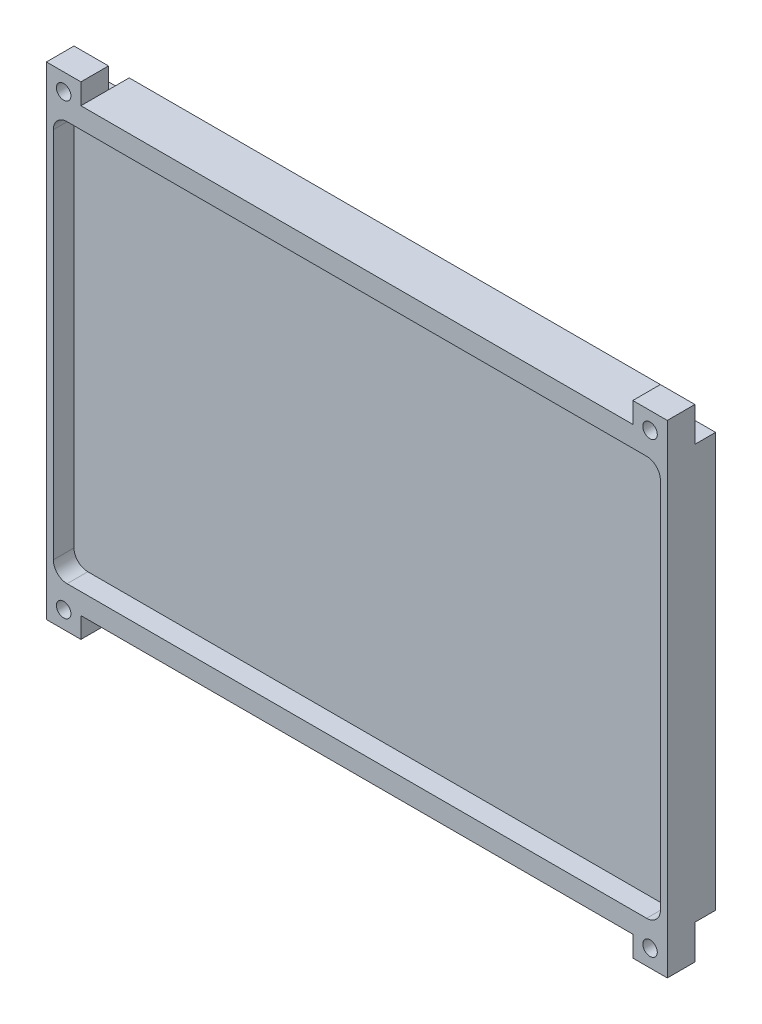
ISO-10303-21;
HEADER;
FILE_DESCRIPTION(('STEP AP214'),'2;1');
FILE_NAME('part.step','',(''),(''),'','','');
FILE_SCHEMA(('AUTOMOTIVE_DESIGN { 1 0 10303 214 1 1 1 1 }'));
ENDSEC;
DATA;
#1=APPLICATION_CONTEXT('core data for automotive mechanical design processes');
#2=APPLICATION_PROTOCOL_DEFINITION('international standard','automotive_design',2000,#1);
#3=PRODUCT_CONTEXT('',#1,'mechanical');
#4=PRODUCT('Part','Part','',(#3));
#5=PRODUCT_RELATED_PRODUCT_CATEGORY('part','',(#4));
#6=PRODUCT_DEFINITION_FORMATION('','',#4);
#7=PRODUCT_DEFINITION_CONTEXT('part definition',#1,'design');
#8=PRODUCT_DEFINITION('design','',#6,#7);
#9=PRODUCT_DEFINITION_SHAPE('','',#8);
#10=(LENGTH_UNIT() NAMED_UNIT(*) SI_UNIT(.MILLI.,.METRE.));
#11=(NAMED_UNIT(*) PLANE_ANGLE_UNIT() SI_UNIT($,.RADIAN.));
#12=(NAMED_UNIT(*) SI_UNIT($,.STERADIAN.) SOLID_ANGLE_UNIT());
#13=UNCERTAINTY_MEASURE_WITH_UNIT(LENGTH_MEASURE(1.E-05),#10,'distance_accuracy_value','');
#14=(GEOMETRIC_REPRESENTATION_CONTEXT(3) GLOBAL_UNCERTAINTY_ASSIGNED_CONTEXT((#13)) GLOBAL_UNIT_ASSIGNED_CONTEXT((#10,
#11,#12)) REPRESENTATION_CONTEXT('',''));
#15=CARTESIAN_POINT('',(0.,0.,0.));
#16=DIRECTION('',(0.,0.,1.));
#17=DIRECTION('',(1.,0.,0.));
#18=AXIS2_PLACEMENT_3D('',#15,#16,#17);
#19=CARTESIAN_POINT('',(-89.0867155495886,42.9813664596273,10.));
#20=DIRECTION('',(0.,1.,0.));
#21=DIRECTION('',(0.,0.,1.));
#22=AXIS2_PLACEMENT_3D('',#19,#20,#21);
#23=PLANE('',#22);
#24=DIRECTION('',(0.,0.,1.));
#25=VECTOR('',#24,1.);
#26=CARTESIAN_POINT('',(-79.0867155495886,42.9813664596273,0.));
#27=LINE('',#26,#25);
#28=CARTESIAN_POINT('',(-79.0867155495886,42.9813664596273,6.));
#29=VERTEX_POINT('',#28);
#30=CARTESIAN_POINT('',(-79.0867155495886,42.9813664596273,10.));
#31=VERTEX_POINT('',#30);
#32=EDGE_CURVE('E254',#29,#31,#27,.T.);
#33=ORIENTED_EDGE('',*,*,#32,.F.);
#34=DIRECTION('',(1.,0.,0.));
#35=VECTOR('',#34,1.);
#36=CARTESIAN_POINT('',(-84.0867155495886,42.9813664596273,6.));
#37=LINE('',#36,#35);
#38=CARTESIAN_POINT('',(-84.0867155495886,42.9813664596273,6.));
#39=VERTEX_POINT('',#38);
#40=EDGE_CURVE('E236',#39,#29,#37,.T.);
#41=ORIENTED_EDGE('',*,*,#40,.F.);
#42=DIRECTION('',(0.,0.,-1.));
#43=VECTOR('',#42,1.);
#44=CARTESIAN_POINT('',(-84.0867155495886,42.9813664596273,3.));
#45=LINE('',#44,#43);
#46=CARTESIAN_POINT('',(-84.0867155495886,42.9813664596273,10.));
#47=VERTEX_POINT('',#46);
#48=EDGE_CURVE('E423',#47,#39,#45,.T.);
#49=ORIENTED_EDGE('',*,*,#48,.F.);
#50=DIRECTION('',(1.,0.,0.));
#51=VECTOR('',#50,1.);
#52=CARTESIAN_POINT('',(-89.0867155495886,42.9813664596273,10.));
#53=LINE('',#52,#51);
#54=EDGE_CURVE('E262',#47,#31,#53,.T.);
#55=ORIENTED_EDGE('',*,*,#54,.T.);
#56=EDGE_LOOP('',(#33,#41,#49,#55));
#57=FACE_BOUND('',#56,.T.);
#58=ADVANCED_FACE('F40',(#57),#23,.T.);
#59=CARTESIAN_POINT('',(-89.0867155495886,-27.0186335403727,10.));
#60=DIRECTION('',(0.,1.,0.));
#61=DIRECTION('',(0.,0.,1.));
#62=AXIS2_PLACEMENT_3D('',#59,#60,#61);
#63=PLANE('',#62);
#64=DIRECTION('',(-1.,0.,0.));
#65=VECTOR('',#64,1.);
#66=CARTESIAN_POINT('',(-84.0867155495886,-27.0186335403727,6.));
#67=LINE('',#66,#65);
#68=CARTESIAN_POINT('',(-79.0867155495886,-27.0186335403727,6.));
#69=VERTEX_POINT('',#68);
#70=CARTESIAN_POINT('',(-84.0867155495886,-27.0186335403727,6.));
#71=VERTEX_POINT('',#70);
#72=EDGE_CURVE('E479',#69,#71,#67,.T.);
#73=ORIENTED_EDGE('',*,*,#72,.F.);
#74=DIRECTION('',(0.,0.,1.));
#75=VECTOR('',#74,1.);
#76=CARTESIAN_POINT('',(-79.0867155495886,-27.0186335403727,0.));
#77=LINE('',#76,#75);
#78=CARTESIAN_POINT('',(-79.0867155495886,-27.0186335403727,10.));
#79=VERTEX_POINT('',#78);
#80=EDGE_CURVE('E297',#69,#79,#77,.T.);
#81=ORIENTED_EDGE('',*,*,#80,.T.);
#82=DIRECTION('',(1.,0.,0.));
#83=VECTOR('',#82,1.);
#84=CARTESIAN_POINT('',(-89.0867155495886,-27.0186335403727,10.));
#85=LINE('',#84,#83);
#86=CARTESIAN_POINT('',(-84.0867155495886,-27.0186335403727,10.));
#87=VERTEX_POINT('',#86);
#88=EDGE_CURVE('E445',#87,#79,#85,.T.);
#89=ORIENTED_EDGE('',*,*,#88,.F.);
#90=DIRECTION('',(0.,0.,1.));
#91=VECTOR('',#90,1.);
#92=CARTESIAN_POINT('',(-84.0867155495886,-27.0186335403727,3.00000000000001));
#93=LINE('',#92,#91);
#94=EDGE_CURVE('E416',#71,#87,#93,.T.);
#95=ORIENTED_EDGE('',*,*,#94,.F.);
#96=EDGE_LOOP('',(#73,#81,#89,#95));
#97=FACE_BOUND('',#96,.T.);
#98=ADVANCED_FACE('F659',(#97),#63,.F.);
#99=DIRECTION('',(0.,0.,1.));
#100=VECTOR('',#99,1.);
#101=CARTESIAN_POINT('',(5.91328445041136,42.9813664596273,3.));
#102=LINE('',#101,#100);
#103=CARTESIAN_POINT('',(5.91328445041136,42.9813664596273,6.));
#104=VERTEX_POINT('',#103);
#105=CARTESIAN_POINT('',(5.91328445041137,42.9813664596273,10.));
#106=VERTEX_POINT('',#105);
#107=EDGE_CURVE('E430',#104,#106,#102,.T.);
#108=ORIENTED_EDGE('',*,*,#107,.F.);
#109=DIRECTION('',(1.,0.,0.));
#110=VECTOR('',#109,1.);
#111=CARTESIAN_POINT('',(5.91328445041136,42.9813664596273,6.));
#112=LINE('',#111,#110);
#113=CARTESIAN_POINT('',(0.913284450411347,42.9813664596273,6.));
#114=VERTEX_POINT('',#113);
#115=EDGE_CURVE('E545',#114,#104,#112,.T.);
#116=ORIENTED_EDGE('',*,*,#115,.F.);
#117=DIRECTION('',(0.,0.,1.));
#118=VECTOR('',#117,1.);
#119=CARTESIAN_POINT('',(0.913284450411375,42.9813664596273,0.));
#120=LINE('',#119,#118);
#121=CARTESIAN_POINT('',(0.913284450411375,42.9813664596273,10.));
#122=VERTEX_POINT('',#121);
#123=EDGE_CURVE('E265',#114,#122,#120,.T.);
#124=ORIENTED_EDGE('',*,*,#123,.T.);
#125=EDGE_CURVE('E441',#122,#106,#53,.T.);
#126=ORIENTED_EDGE('',*,*,#125,.T.);
#127=EDGE_LOOP('',(#108,#116,#124,#126));
#128=FACE_BOUND('',#127,.T.);
#129=ADVANCED_FACE('F614',(#128),#23,.T.);
#130=DIRECTION('',(-1.,0.,0.));
#131=VECTOR('',#130,1.);
#132=CARTESIAN_POINT('',(5.91328445041136,-27.0186335403727,6.));
#133=LINE('',#132,#131);
#134=CARTESIAN_POINT('',(5.91328445041136,-27.0186335403727,6.));
#135=VERTEX_POINT('',#134);
#136=CARTESIAN_POINT('',(0.91328445041132,-27.0186335403727,6.));
#137=VERTEX_POINT('',#136);
#138=EDGE_CURVE('E55',#135,#137,#133,.T.);
#139=ORIENTED_EDGE('',*,*,#138,.F.);
#140=DIRECTION('',(0.,0.,-1.));
#141=VECTOR('',#140,1.);
#142=CARTESIAN_POINT('',(5.91328445041137,-27.0186335403727,2.99999999999999));
#143=LINE('',#142,#141);
#144=CARTESIAN_POINT('',(5.91328445041137,-27.0186335403727,10.));
#145=VERTEX_POINT('',#144);
#146=EDGE_CURVE('E437',#145,#135,#143,.T.);
#147=ORIENTED_EDGE('',*,*,#146,.F.);
#148=CARTESIAN_POINT('',(0.91328445041132,-27.0186335403727,10.));
#149=VERTEX_POINT('',#148);
#150=EDGE_CURVE('E444',#149,#145,#85,.T.);
#151=ORIENTED_EDGE('',*,*,#150,.F.);
#152=DIRECTION('',(0.,0.,1.));
#153=VECTOR('',#152,1.);
#154=CARTESIAN_POINT('',(0.91328445041132,-27.0186335403727,0.));
#155=LINE('',#154,#153);
#156=EDGE_CURVE('E308',#137,#149,#155,.T.);
#157=ORIENTED_EDGE('',*,*,#156,.F.);
#158=EDGE_LOOP('',(#139,#147,#151,#157));
#159=FACE_BOUND('',#158,.T.);
#160=ADVANCED_FACE('F607',(#159),#63,.F.);
#161=CARTESIAN_POINT('',(3.41328445041136,-24.5186335403727,42.));
#162=DIRECTION('',(0.,0.,-1.));
#163=DIRECTION('',(-1.,0.,0.));
#164=AXIS2_PLACEMENT_3D('',#161,#162,#163);
#165=CYLINDRICAL_SURFACE('',#164,1.05);
#166=CARTESIAN_POINT('',(3.41328445041142,-24.5186335403727,10.));
#167=DIRECTION('',(0.,0.,1.));
#168=DIRECTION('',(1.,0.,0.));
#169=AXIS2_PLACEMENT_3D('',#166,#167,#168);
#170=CIRCLE('',#169,1.04999999999999);
#171=CARTESIAN_POINT('',(4.46328445041141,-24.5186335403727,10.));
#172=VERTEX_POINT('',#171);
#173=EDGE_CURVE('E270',#172,#172,#170,.T.);
#174=ORIENTED_EDGE('',*,*,#173,.T.);
#175=EDGE_LOOP('',(#174));
#176=FACE_BOUND('',#175,.T.);
#177=CARTESIAN_POINT('',(3.41328445041136,-24.5186335403727,6.));
#178=DIRECTION('',(0.,0.,-1.));
#179=DIRECTION('',(-1.,0.,0.));
#180=AXIS2_PLACEMENT_3D('',#177,#178,#179);
#181=CIRCLE('',#180,1.05);
#182=CARTESIAN_POINT('',(2.36328445041136,-24.5186335403727,6.));
#183=VERTEX_POINT('',#182);
#184=EDGE_CURVE('E569',#183,#183,#181,.F.);
#185=ORIENTED_EDGE('',*,*,#184,.F.);
#186=EDGE_LOOP('',(#185));
#187=FACE_BOUND('',#186,.T.);
#188=ADVANCED_FACE('F669',(#176,#187),#165,.F.);
#189=CARTESIAN_POINT('',(-81.5867155495886,-24.5186335403727,42.));
#190=DIRECTION('',(0.,0.,-1.));
#191=DIRECTION('',(-1.,0.,0.));
#192=AXIS2_PLACEMENT_3D('',#189,#190,#191);
#193=CYLINDRICAL_SURFACE('',#192,1.04999999999999);
#194=CARTESIAN_POINT('',(-81.5867155495887,-24.5186335403727,10.));
#195=DIRECTION('',(0.,0.,1.));
#196=DIRECTION('',(-1.,0.,0.));
#197=AXIS2_PLACEMENT_3D('',#194,#195,#196);
#198=CIRCLE('',#197,1.04999999999999);
#199=CARTESIAN_POINT('',(-82.6367155495887,-24.5186335403727,10.));
#200=VERTEX_POINT('',#199);
#201=EDGE_CURVE('E264',#200,#200,#198,.T.);
#202=ORIENTED_EDGE('',*,*,#201,.T.);
#203=EDGE_LOOP('',(#202));
#204=FACE_BOUND('',#203,.T.);
#205=CARTESIAN_POINT('',(-81.5867155495886,-24.5186335403727,6.));
#206=DIRECTION('',(0.,0.,-1.));
#207=DIRECTION('',(-1.,0.,0.));
#208=AXIS2_PLACEMENT_3D('',#205,#206,#207);
#209=CIRCLE('',#208,1.04999999999999);
#210=CARTESIAN_POINT('',(-82.6367155495886,-24.5186335403727,6.));
#211=VERTEX_POINT('',#210);
#212=EDGE_CURVE('E289',#211,#211,#209,.F.);
#213=ORIENTED_EDGE('',*,*,#212,.F.);
#214=EDGE_LOOP('',(#213));
#215=FACE_BOUND('',#214,.T.);
#216=ADVANCED_FACE('F673',(#204,#215),#193,.F.);
#217=CARTESIAN_POINT('',(-81.5867155495887,40.4813664596273,42.));
#218=DIRECTION('',(0.,0.,-1.));
#219=DIRECTION('',(-1.,0.,0.));
#220=AXIS2_PLACEMENT_3D('',#217,#218,#219);
#221=CYLINDRICAL_SURFACE('',#220,1.04999999999999);
#222=CARTESIAN_POINT('',(-81.5867155495887,40.4813664596273,10.));
#223=DIRECTION('',(0.,0.,1.));
#224=DIRECTION('',(1.,0.,0.));
#225=AXIS2_PLACEMENT_3D('',#222,#223,#224);
#226=CIRCLE('',#225,1.04999999999999);
#227=CARTESIAN_POINT('',(-80.5367155495887,40.4813664596273,10.));
#228=VERTEX_POINT('',#227);
#229=EDGE_CURVE('E320',#228,#228,#226,.T.);
#230=ORIENTED_EDGE('',*,*,#229,.T.);
#231=EDGE_LOOP('',(#230));
#232=FACE_BOUND('',#231,.T.);
#233=CARTESIAN_POINT('',(-81.5867155495887,40.4813664596273,6.));
#234=DIRECTION('',(0.,0.,-1.));
#235=DIRECTION('',(-1.,0.,0.));
#236=AXIS2_PLACEMENT_3D('',#233,#234,#235);
#237=CIRCLE('',#236,1.04999999999999);
#238=CARTESIAN_POINT('',(-82.6367155495887,40.4813664596273,6.));
#239=VERTEX_POINT('',#238);
#240=EDGE_CURVE('E565',#239,#239,#237,.F.);
#241=ORIENTED_EDGE('',*,*,#240,.F.);
#242=EDGE_LOOP('',(#241));
#243=FACE_BOUND('',#242,.T.);
#244=ADVANCED_FACE('F683',(#232,#243),#221,.F.);
#245=CARTESIAN_POINT('',(3.41328445041138,40.4813664596273,42.));
#246=DIRECTION('',(0.,0.,-1.));
#247=DIRECTION('',(-1.,0.,0.));
#248=AXIS2_PLACEMENT_3D('',#245,#246,#247);
#249=CYLINDRICAL_SURFACE('',#248,1.05);
#250=CARTESIAN_POINT('',(3.41328445041142,40.4813664596273,10.));
#251=DIRECTION('',(0.,0.,1.));
#252=DIRECTION('',(-1.,0.,0.));
#253=AXIS2_PLACEMENT_3D('',#250,#251,#252);
#254=CIRCLE('',#253,1.04999999999999);
#255=CARTESIAN_POINT('',(2.36328445041143,40.4813664596273,10.));
#256=VERTEX_POINT('',#255);
#257=EDGE_CURVE('E316',#256,#256,#254,.T.);
#258=ORIENTED_EDGE('',*,*,#257,.T.);
#259=EDGE_LOOP('',(#258));
#260=FACE_BOUND('',#259,.T.);
#261=CARTESIAN_POINT('',(3.41328445041138,40.4813664596273,6.));
#262=DIRECTION('',(0.,0.,-1.));
#263=DIRECTION('',(-1.,0.,0.));
#264=AXIS2_PLACEMENT_3D('',#261,#262,#263);
#265=CIRCLE('',#264,1.05);
#266=CARTESIAN_POINT('',(2.36328445041138,40.4813664596273,6.));
#267=VERTEX_POINT('',#266);
#268=EDGE_CURVE('E559',#267,#267,#265,.F.);
#269=ORIENTED_EDGE('',*,*,#268,.F.);
#270=EDGE_LOOP('',(#269));
#271=FACE_BOUND('',#270,.T.);
#272=ADVANCED_FACE('F681',(#260,#271),#249,.F.);
#273=CARTESIAN_POINT('',(-79.0867155495886,-27.0186335403727,0.));
#274=DIRECTION('',(-1.,0.,0.));
#275=DIRECTION('',(0.,0.,1.));
#276=AXIS2_PLACEMENT_3D('',#273,#274,#275);
#277=PLANE('',#276);
#278=DIRECTION('',(0.,-1.,0.));
#279=VECTOR('',#278,1.);
#280=CARTESIAN_POINT('',(-79.0867155495886,-27.0186335403727,6.));
#281=LINE('',#280,#279);
#282=CARTESIAN_POINT('',(-79.0867155495886,-24.0186335403727,6.));
#283=VERTEX_POINT('',#282);
#284=EDGE_CURVE('E475',#283,#69,#281,.T.);
#285=ORIENTED_EDGE('',*,*,#284,.F.);
#286=DIRECTION('',(0.,0.,1.));
#287=VECTOR('',#286,1.);
#288=CARTESIAN_POINT('',(-79.0867155495886,-24.0186335403727,0.));
#289=LINE('',#288,#287);
#290=CARTESIAN_POINT('',(-79.0867155495886,-24.0186335403727,10.));
#291=VERTEX_POINT('',#290);
#292=EDGE_CURVE('E302',#283,#291,#289,.T.);
#293=ORIENTED_EDGE('',*,*,#292,.T.);
#294=DIRECTION('',(0.,-1.,0.));
#295=VECTOR('',#294,1.);
#296=CARTESIAN_POINT('',(-79.0867155495886,-27.0186335403727,10.));
#297=LINE('',#296,#295);
#298=EDGE_CURVE('E284',#291,#79,#297,.T.);
#299=ORIENTED_EDGE('',*,*,#298,.T.);
#300=ORIENTED_EDGE('',*,*,#80,.F.);
#301=EDGE_LOOP('',(#285,#293,#299,#300));
#302=FACE_BOUND('',#301,.T.);
#303=ADVANCED_FACE('F483',(#302),#277,.F.);
#304=CARTESIAN_POINT('',(0.91328445041132,-27.0186335403727,0.));
#305=DIRECTION('',(1.,0.,0.));
#306=DIRECTION('',(0.,0.,-1.));
#307=AXIS2_PLACEMENT_3D('',#304,#305,#306);
#308=PLANE('',#307);
#309=DIRECTION('',(0.,1.,0.));
#310=VECTOR('',#309,1.);
#311=CARTESIAN_POINT('',(0.913284450411351,-27.0186335403727,6.));
#312=LINE('',#311,#310);
#313=CARTESIAN_POINT('',(0.913284450411351,-24.0186335403727,6.));
#314=VERTEX_POINT('',#313);
#315=EDGE_CURVE('E510',#137,#314,#312,.T.);
#316=ORIENTED_EDGE('',*,*,#315,.F.);
#317=ORIENTED_EDGE('',*,*,#156,.T.);
#318=DIRECTION('',(0.,1.,0.));
#319=VECTOR('',#318,1.);
#320=CARTESIAN_POINT('',(0.91328445041132,-27.0186335403727,10.));
#321=LINE('',#320,#319);
#322=CARTESIAN_POINT('',(0.91328445041132,-24.0186335403727,10.));
#323=VERTEX_POINT('',#322);
#324=EDGE_CURVE('E288',#149,#323,#321,.T.);
#325=ORIENTED_EDGE('',*,*,#324,.T.);
#326=DIRECTION('',(0.,0.,1.));
#327=VECTOR('',#326,1.);
#328=CARTESIAN_POINT('',(0.91328445041132,-24.0186335403727,0.));
#329=LINE('',#328,#327);
#330=EDGE_CURVE('E307',#314,#323,#329,.T.);
#331=ORIENTED_EDGE('',*,*,#330,.F.);
#332=EDGE_LOOP('',(#316,#317,#325,#331));
#333=FACE_BOUND('',#332,.T.);
#334=ADVANCED_FACE('F734',(#333),#308,.F.);
#335=CARTESIAN_POINT('',(-79.0867155495886,42.9813664596273,0.));
#336=DIRECTION('',(-1.,0.,0.));
#337=DIRECTION('',(0.,0.,1.));
#338=AXIS2_PLACEMENT_3D('',#335,#336,#337);
#339=PLANE('',#338);
#340=DIRECTION('',(0.,-1.,0.));
#341=VECTOR('',#340,1.);
#342=CARTESIAN_POINT('',(-79.0867155495886,42.9813664596273,6.));
#343=LINE('',#342,#341);
#344=CARTESIAN_POINT('',(-79.0867155495886,39.9813664596273,6.));
#345=VERTEX_POINT('',#344);
#346=EDGE_CURVE('E63',#29,#345,#343,.T.);
#347=ORIENTED_EDGE('',*,*,#346,.F.);
#348=ORIENTED_EDGE('',*,*,#32,.T.);
#349=DIRECTION('',(0.,-1.,0.));
#350=VECTOR('',#349,1.);
#351=CARTESIAN_POINT('',(-79.0867155495886,42.9813664596273,10.));
#352=LINE('',#351,#350);
#353=CARTESIAN_POINT('',(-79.0867155495886,39.9813664596273,10.));
#354=VERTEX_POINT('',#353);
#355=EDGE_CURVE('E301',#31,#354,#352,.T.);
#356=ORIENTED_EDGE('',*,*,#355,.T.);
#357=DIRECTION('',(0.,0.,1.));
#358=VECTOR('',#357,1.);
#359=CARTESIAN_POINT('',(-79.0867155495886,39.9813664596273,0.));
#360=LINE('',#359,#358);
#361=EDGE_CURVE('E256',#345,#354,#360,.T.);
#362=ORIENTED_EDGE('',*,*,#361,.F.);
#363=EDGE_LOOP('',(#347,#348,#356,#362));
#364=FACE_BOUND('',#363,.T.);
#365=ADVANCED_FACE('F252',(#364),#339,.F.);
#366=CARTESIAN_POINT('',(0.913284450411375,42.9813664596273,0.));
#367=DIRECTION('',(1.,0.,0.));
#368=DIRECTION('',(0.,0.,-1.));
#369=AXIS2_PLACEMENT_3D('',#366,#367,#368);
#370=PLANE('',#369);
#371=DIRECTION('',(0.,1.,0.));
#372=VECTOR('',#371,1.);
#373=CARTESIAN_POINT('',(0.913284450411347,42.9813664596273,6.));
#374=LINE('',#373,#372);
#375=CARTESIAN_POINT('',(0.913284450411347,39.9813664596273,6.));
#376=VERTEX_POINT('',#375);
#377=EDGE_CURVE('E540',#376,#114,#374,.T.);
#378=ORIENTED_EDGE('',*,*,#377,.F.);
#379=DIRECTION('',(0.,0.,1.));
#380=VECTOR('',#379,1.);
#381=CARTESIAN_POINT('',(0.913284450411375,39.9813664596273,0.));
#382=LINE('',#381,#380);
#383=CARTESIAN_POINT('',(0.913284450411375,39.9813664596273,10.));
#384=VERTEX_POINT('',#383);
#385=EDGE_CURVE('E280',#376,#384,#382,.T.);
#386=ORIENTED_EDGE('',*,*,#385,.T.);
#387=DIRECTION('',(0.,1.,0.));
#388=VECTOR('',#387,1.);
#389=CARTESIAN_POINT('',(0.913284450411375,42.9813664596273,10.));
#390=LINE('',#389,#388);
#391=EDGE_CURVE('E275',#384,#122,#390,.T.);
#392=ORIENTED_EDGE('',*,*,#391,.T.);
#393=ORIENTED_EDGE('',*,*,#123,.F.);
#394=EDGE_LOOP('',(#378,#386,#392,#393));
#395=FACE_BOUND('',#394,.T.);
#396=ADVANCED_FACE('F617',(#395),#370,.F.);
#397=CARTESIAN_POINT('',(0.,0.,10.));
#398=DIRECTION('',(0.,0.,-1.));
#399=DIRECTION('',(-1.,0.,0.));
#400=AXIS2_PLACEMENT_3D('',#397,#398,#399);
#401=PLANE('',#400);
#402=DIRECTION('',(1.,0.,0.));
#403=VECTOR('',#402,1.);
#404=CARTESIAN_POINT('',(-79.0867155495886,39.9813664596273,10.));
#405=LINE('',#404,#403);
#406=EDGE_CURVE('E577',#354,#384,#405,.T.);
#407=ORIENTED_EDGE('',*,*,#406,.F.);
#408=ORIENTED_EDGE('',*,*,#355,.F.);
#409=ORIENTED_EDGE('',*,*,#54,.F.);
#410=DIRECTION('',(0.,1.,0.));
#411=VECTOR('',#410,1.);
#412=CARTESIAN_POINT('',(-84.0867155495886,42.9813664596273,10.));
#413=LINE('',#412,#411);
#414=EDGE_CURVE('E419',#87,#47,#413,.T.);
#415=ORIENTED_EDGE('',*,*,#414,.F.);
#416=ORIENTED_EDGE('',*,*,#88,.T.);
#417=ORIENTED_EDGE('',*,*,#298,.F.);
#418=DIRECTION('',(-1.,0.,0.));
#419=VECTOR('',#418,1.);
#420=CARTESIAN_POINT('',(-79.0867155495886,-24.0186335403727,10.));
#421=LINE('',#420,#419);
#422=EDGE_CURVE('E293',#323,#291,#421,.T.);
#423=ORIENTED_EDGE('',*,*,#422,.F.);
#424=ORIENTED_EDGE('',*,*,#324,.F.);
#425=ORIENTED_EDGE('',*,*,#150,.T.);
#426=DIRECTION('',(0.,-1.,0.));
#427=VECTOR('',#426,1.);
#428=CARTESIAN_POINT('',(5.91328445041136,42.9813664596273,10.));
#429=LINE('',#428,#427);
#430=EDGE_CURVE('E433',#106,#145,#429,.T.);
#431=ORIENTED_EDGE('',*,*,#430,.F.);
#432=ORIENTED_EDGE('',*,*,#125,.F.);
#433=ORIENTED_EDGE('',*,*,#391,.F.);
#434=EDGE_LOOP('',(#407,#408,#409,#415,#416,#417,#423,#424,#425,#431,#432,#433));
#435=FACE_BOUND('',#434,.T.);
#436=DIRECTION('',(1.,0.,0.));
#437=VECTOR('',#436,1.);
#438=CARTESIAN_POINT('',(-81.0867155495886,-21.0186335403727,10.));
#439=LINE('',#438,#437);
#440=CARTESIAN_POINT('',(-81.0867155495886,-21.0186335403727,10.));
#441=VERTEX_POINT('',#440);
#442=CARTESIAN_POINT('',(2.91328445041136,-21.0186335403727,10.));
#443=VERTEX_POINT('',#442);
#444=EDGE_CURVE('E361',#441,#443,#439,.T.);
#445=ORIENTED_EDGE('',*,*,#444,.F.);
#446=CARTESIAN_POINT('',(-81.0867155495886,-19.0186335403727,10.));
#447=DIRECTION('',(0.,0.,1.));
#448=DIRECTION('',(-1.,0.,0.));
#449=AXIS2_PLACEMENT_3D('',#446,#447,#448);
#450=CIRCLE('',#449,2.);
#451=CARTESIAN_POINT('',(-83.0867155495886,-19.0186335403727,10.));
#452=VERTEX_POINT('',#451);
#453=EDGE_CURVE('E324',#452,#441,#450,.T.);
#454=ORIENTED_EDGE('',*,*,#453,.F.);
#455=DIRECTION('',(0.,-1.,0.));
#456=VECTOR('',#455,1.);
#457=CARTESIAN_POINT('',(-83.0867155495886,34.9813664596273,10.));
#458=LINE('',#457,#456);
#459=CARTESIAN_POINT('',(-83.0867155495886,34.9813664596273,10.));
#460=VERTEX_POINT('',#459);
#461=EDGE_CURVE('E330',#460,#452,#458,.T.);
#462=ORIENTED_EDGE('',*,*,#461,.F.);
#463=CARTESIAN_POINT('',(-81.0867155495886,34.9813664596273,10.));
#464=DIRECTION('',(0.,0.,1.));
#465=DIRECTION('',(-1.,0.,0.));
#466=AXIS2_PLACEMENT_3D('',#463,#464,#465);
#467=CIRCLE('',#466,2.);
#468=CARTESIAN_POINT('',(-81.0867155495886,36.9813664596273,10.));
#469=VERTEX_POINT('',#468);
#470=EDGE_CURVE('E381',#469,#460,#467,.T.);
#471=ORIENTED_EDGE('',*,*,#470,.F.);
#472=DIRECTION('',(-1.,0.,0.));
#473=VECTOR('',#472,1.);
#474=CARTESIAN_POINT('',(-81.0867155495886,36.9813664596273,10.));
#475=LINE('',#474,#473);
#476=CARTESIAN_POINT('',(2.91328445041136,36.9813664596273,10.));
#477=VERTEX_POINT('',#476);
#478=EDGE_CURVE('E377',#477,#469,#475,.T.);
#479=ORIENTED_EDGE('',*,*,#478,.F.);
#480=CARTESIAN_POINT('',(2.91328445041138,34.9813664596273,10.));
#481=DIRECTION('',(0.,0.,1.));
#482=DIRECTION('',(-1.,0.,0.));
#483=AXIS2_PLACEMENT_3D('',#480,#481,#482);
#484=CIRCLE('',#483,2.);
#485=CARTESIAN_POINT('',(4.91328445041138,34.9813664596273,10.));
#486=VERTEX_POINT('',#485);
#487=EDGE_CURVE('E373',#486,#477,#484,.T.);
#488=ORIENTED_EDGE('',*,*,#487,.F.);
#489=DIRECTION('',(0.,1.,0.));
#490=VECTOR('',#489,1.);
#491=CARTESIAN_POINT('',(4.91328445041138,34.9813664596273,10.));
#492=LINE('',#491,#490);
#493=CARTESIAN_POINT('',(4.91328445041138,-19.0186335403727,10.));
#494=VERTEX_POINT('',#493);
#495=EDGE_CURVE('E369',#494,#486,#492,.T.);
#496=ORIENTED_EDGE('',*,*,#495,.F.);
#497=CARTESIAN_POINT('',(2.91328445041138,-19.0186335403727,10.));
#498=DIRECTION('',(0.,0.,1.));
#499=DIRECTION('',(1.,0.,0.));
#500=AXIS2_PLACEMENT_3D('',#497,#498,#499);
#501=CIRCLE('',#500,2.);
#502=EDGE_CURVE('E365',#443,#494,#501,.T.);
#503=ORIENTED_EDGE('',*,*,#502,.F.);
#504=EDGE_LOOP('',(#445,#454,#462,#471,#479,#488,#496,#503));
#505=FACE_BOUND('',#504,.T.);
#506=ORIENTED_EDGE('',*,*,#229,.F.);
#507=EDGE_LOOP('',(#506));
#508=FACE_BOUND('',#507,.T.);
#509=ORIENTED_EDGE('',*,*,#257,.F.);
#510=EDGE_LOOP('',(#509));
#511=FACE_BOUND('',#510,.T.);
#512=ORIENTED_EDGE('',*,*,#173,.F.);
#513=EDGE_LOOP('',(#512));
#514=FACE_BOUND('',#513,.T.);
#515=ORIENTED_EDGE('',*,*,#201,.F.);
#516=EDGE_LOOP('',(#515));
#517=FACE_BOUND('',#516,.T.);
#518=ADVANCED_FACE('F593',(#435,#505,#508,#511,#514,#517),#401,.F.);
#519=CARTESIAN_POINT('',(0.,0.,3.));
#520=DIRECTION('',(0.,0.,1.));
#521=DIRECTION('',(1.,0.,0.));
#522=AXIS2_PLACEMENT_3D('',#519,#520,#521);
#523=PLANE('',#522);
#524=DIRECTION('',(0.,1.,0.));
#525=VECTOR('',#524,1.);
#526=CARTESIAN_POINT('',(5.91328445041136,42.9813664596273,3.));
#527=LINE('',#526,#525);
#528=CARTESIAN_POINT('',(5.91328445041136,-22.0186335403727,3.));
#529=VERTEX_POINT('',#528);
#530=CARTESIAN_POINT('',(5.91328445041136,37.9813664596273,3.));
#531=VERTEX_POINT('',#530);
#532=EDGE_CURVE('E426',#529,#531,#527,.T.);
#533=ORIENTED_EDGE('',*,*,#532,.F.);
#534=DIRECTION('',(1.,0.,0.));
#535=VECTOR('',#534,1.);
#536=CARTESIAN_POINT('',(5.91328445041136,-22.0186335403727,3.));
#537=LINE('',#536,#535);
#538=CARTESIAN_POINT('',(0.913284450411351,-22.0186335403727,3.));
#539=VERTEX_POINT('',#538);
#540=EDGE_CURVE('E509',#539,#529,#537,.T.);
#541=ORIENTED_EDGE('',*,*,#540,.F.);
#542=DIRECTION('',(0.,1.,0.));
#543=VECTOR('',#542,1.);
#544=CARTESIAN_POINT('',(0.913284450411351,-27.0186335403727,3.));
#545=LINE('',#544,#543);
#546=CARTESIAN_POINT('',(0.913284450411351,-24.0186335403727,3.));
#547=VERTEX_POINT('',#546);
#548=EDGE_CURVE('E459',#547,#539,#545,.T.);
#549=ORIENTED_EDGE('',*,*,#548,.F.);
#550=DIRECTION('',(-1.,0.,0.));
#551=VECTOR('',#550,1.);
#552=CARTESIAN_POINT('',(0.,-24.0186335403727,3.));
#553=LINE('',#552,#551);
#554=CARTESIAN_POINT('',(-79.0867155495886,-24.0186335403727,3.));
#555=VERTEX_POINT('',#554);
#556=EDGE_CURVE('E48',#547,#555,#553,.T.);
#557=ORIENTED_EDGE('',*,*,#556,.T.);
#558=DIRECTION('',(0.,-1.,0.));
#559=VECTOR('',#558,1.);
#560=CARTESIAN_POINT('',(-79.0867155495886,-27.0186335403727,3.));
#561=LINE('',#560,#559);
#562=CARTESIAN_POINT('',(-79.0867155495886,-22.0186335403727,3.));
#563=VERTEX_POINT('',#562);
#564=EDGE_CURVE('E457',#563,#555,#561,.T.);
#565=ORIENTED_EDGE('',*,*,#564,.F.);
#566=DIRECTION('',(1.,0.,0.));
#567=VECTOR('',#566,1.);
#568=CARTESIAN_POINT('',(-84.0867155495886,-22.0186335403727,3.));
#569=LINE('',#568,#567);
#570=CARTESIAN_POINT('',(-84.0867155495886,-22.0186335403727,3.));
#571=VERTEX_POINT('',#570);
#572=EDGE_CURVE('E493',#571,#563,#569,.T.);
#573=ORIENTED_EDGE('',*,*,#572,.F.);
#574=DIRECTION('',(0.,-1.,0.));
#575=VECTOR('',#574,1.);
#576=CARTESIAN_POINT('',(-84.0867155495886,42.9813664596273,3.));
#577=LINE('',#576,#575);
#578=CARTESIAN_POINT('',(-84.0867155495886,37.9813664596273,3.));
#579=VERTEX_POINT('',#578);
#580=EDGE_CURVE('E391',#579,#571,#577,.T.);
#581=ORIENTED_EDGE('',*,*,#580,.F.);
#582=DIRECTION('',(-1.,0.,0.));
#583=VECTOR('',#582,1.);
#584=CARTESIAN_POINT('',(-84.0867155495886,37.9813664596273,3.));
#585=LINE('',#584,#583);
#586=CARTESIAN_POINT('',(-79.0867155495886,37.9813664596273,3.));
#587=VERTEX_POINT('',#586);
#588=EDGE_CURVE('E248',#587,#579,#585,.T.);
#589=ORIENTED_EDGE('',*,*,#588,.F.);
#590=DIRECTION('',(0.,-1.,0.));
#591=VECTOR('',#590,1.);
#592=CARTESIAN_POINT('',(-79.0867155495886,42.9813664596273,3.));
#593=LINE('',#592,#591);
#594=CARTESIAN_POINT('',(-79.0867155495886,39.9813664596273,3.));
#595=VERTEX_POINT('',#594);
#596=EDGE_CURVE('E503',#595,#587,#593,.T.);
#597=ORIENTED_EDGE('',*,*,#596,.F.);
#598=DIRECTION('',(1.,0.,0.));
#599=VECTOR('',#598,1.);
#600=CARTESIAN_POINT('',(0.,39.9813664596273,3.));
#601=LINE('',#600,#599);
#602=CARTESIAN_POINT('',(0.913284450411375,39.9813664596273,3.));
#603=VERTEX_POINT('',#602);
#604=EDGE_CURVE('E11',#595,#603,#601,.T.);
#605=ORIENTED_EDGE('',*,*,#604,.T.);
#606=DIRECTION('',(0.,1.,0.));
#607=VECTOR('',#606,1.);
#608=CARTESIAN_POINT('',(0.913284450411347,42.9813664596273,3.));
#609=LINE('',#608,#607);
#610=CARTESIAN_POINT('',(0.913284450411347,37.9813664596273,3.));
#611=VERTEX_POINT('',#610);
#612=EDGE_CURVE('E536',#611,#603,#609,.T.);
#613=ORIENTED_EDGE('',*,*,#612,.F.);
#614=DIRECTION('',(-1.,0.,0.));
#615=VECTOR('',#614,1.);
#616=CARTESIAN_POINT('',(5.91328445041136,37.9813664596273,3.));
#617=LINE('',#616,#615);
#618=EDGE_CURVE('E549',#531,#611,#617,.T.);
#619=ORIENTED_EDGE('',*,*,#618,.F.);
#620=EDGE_LOOP('',(#533,#541,#549,#557,#565,#573,#581,#589,#597,#605,#613,#619));
#621=FACE_BOUND('',#620,.T.);
#622=ADVANCED_FACE('F455',(#621),#523,.F.);
#623=CARTESIAN_POINT('',(5.91328445041137,0.,0.));
#624=DIRECTION('',(-1.,0.,0.));
#625=DIRECTION('',(0.,-1.,0.));
#626=AXIS2_PLACEMENT_3D('',#623,#624,#625);
#627=PLANE('',#626);
#628=DIRECTION('',(0.,-1.,0.));
#629=VECTOR('',#628,1.);
#630=CARTESIAN_POINT('',(5.91328445041136,-27.0186335403727,6.));
#631=LINE('',#630,#629);
#632=CARTESIAN_POINT('',(5.91328445041136,-22.0186335403727,6.));
#633=VERTEX_POINT('',#632);
#634=EDGE_CURVE('E517',#633,#135,#631,.T.);
#635=ORIENTED_EDGE('',*,*,#634,.F.);
#636=DIRECTION('',(0.,0.,-1.));
#637=VECTOR('',#636,1.);
#638=CARTESIAN_POINT('',(5.91328445041136,-22.0186335403727,6.));
#639=LINE('',#638,#637);
#640=EDGE_CURVE('E497',#633,#529,#639,.T.);
#641=ORIENTED_EDGE('',*,*,#640,.T.);
#642=ORIENTED_EDGE('',*,*,#532,.T.);
#643=DIRECTION('',(0.,0.,-1.));
#644=VECTOR('',#643,1.);
#645=CARTESIAN_POINT('',(5.91328445041136,37.9813664596273,6.));
#646=LINE('',#645,#644);
#647=CARTESIAN_POINT('',(5.91328445041136,37.9813664596273,6.));
#648=VERTEX_POINT('',#647);
#649=EDGE_CURVE('E548',#648,#531,#646,.T.);
#650=ORIENTED_EDGE('',*,*,#649,.F.);
#651=DIRECTION('',(0.,-1.,0.));
#652=VECTOR('',#651,1.);
#653=CARTESIAN_POINT('',(5.91328445041136,42.9813664596273,6.));
#654=LINE('',#653,#652);
#655=EDGE_CURVE('E531',#104,#648,#654,.T.);
#656=ORIENTED_EDGE('',*,*,#655,.F.);
#657=ORIENTED_EDGE('',*,*,#107,.T.);
#658=ORIENTED_EDGE('',*,*,#430,.T.);
#659=ORIENTED_EDGE('',*,*,#146,.T.);
#660=EDGE_LOOP('',(#635,#641,#642,#650,#656,#657,#658,#659));
#661=FACE_BOUND('',#660,.T.);
#662=ADVANCED_FACE('F610',(#661),#627,.F.);
#663=CARTESIAN_POINT('',(-84.0867155495886,0.,0.));
#664=DIRECTION('',(-1.,0.,0.));
#665=DIRECTION('',(0.,0.,1.));
#666=AXIS2_PLACEMENT_3D('',#663,#664,#665);
#667=PLANE('',#666);
#668=DIRECTION('',(0.,0.,-1.));
#669=VECTOR('',#668,1.);
#670=CARTESIAN_POINT('',(-84.0867155495886,-22.0186335403727,6.));
#671=LINE('',#670,#669);
#672=CARTESIAN_POINT('',(-84.0867155495886,-22.0186335403727,6.));
#673=VERTEX_POINT('',#672);
#674=EDGE_CURVE('E492',#673,#571,#671,.T.);
#675=ORIENTED_EDGE('',*,*,#674,.F.);
#676=DIRECTION('',(0.,1.,0.));
#677=VECTOR('',#676,1.);
#678=CARTESIAN_POINT('',(-84.0867155495886,-27.0186335403727,6.));
#679=LINE('',#678,#677);
#680=EDGE_CURVE('E486',#71,#673,#679,.T.);
#681=ORIENTED_EDGE('',*,*,#680,.F.);
#682=ORIENTED_EDGE('',*,*,#94,.T.);
#683=ORIENTED_EDGE('',*,*,#414,.T.);
#684=ORIENTED_EDGE('',*,*,#48,.T.);
#685=DIRECTION('',(0.,1.,0.));
#686=VECTOR('',#685,1.);
#687=CARTESIAN_POINT('',(-84.0867155495886,42.9813664596273,6.));
#688=LINE('',#687,#686);
#689=CARTESIAN_POINT('',(-84.0867155495886,37.9813664596273,6.));
#690=VERTEX_POINT('',#689);
#691=EDGE_CURVE('E241',#690,#39,#688,.T.);
#692=ORIENTED_EDGE('',*,*,#691,.F.);
#693=DIRECTION('',(0.,0.,-1.));
#694=VECTOR('',#693,1.);
#695=CARTESIAN_POINT('',(-84.0867155495886,37.9813664596273,6.));
#696=LINE('',#695,#694);
#697=EDGE_CURVE('E553',#690,#579,#696,.T.);
#698=ORIENTED_EDGE('',*,*,#697,.T.);
#699=ORIENTED_EDGE('',*,*,#580,.T.);
#700=EDGE_LOOP('',(#675,#681,#682,#683,#684,#692,#698,#699));
#701=FACE_BOUND('',#700,.T.);
#702=ADVANCED_FACE('F648',(#701),#667,.T.);
#703=CARTESIAN_POINT('',(-81.0867155495886,-19.0186335403727,7.));
#704=DIRECTION('',(0.,0.,1.));
#705=DIRECTION('',(1.,0.,0.));
#706=AXIS2_PLACEMENT_3D('',#703,#704,#705);
#707=CYLINDRICAL_SURFACE('',#706,2.);
#708=ORIENTED_EDGE('',*,*,#453,.T.);
#709=DIRECTION('',(0.,0.,1.));
#710=VECTOR('',#709,1.);
#711=CARTESIAN_POINT('',(-81.0867155495886,-21.0186335403727,7.));
#712=LINE('',#711,#710);
#713=CARTESIAN_POINT('',(-81.0867155495886,-21.0186335403727,7.));
#714=VERTEX_POINT('',#713);
#715=EDGE_CURVE('E358',#714,#441,#712,.T.);
#716=ORIENTED_EDGE('',*,*,#715,.F.);
#717=CARTESIAN_POINT('',(-81.0867155495886,-19.0186335403727,7.));
#718=DIRECTION('',(0.,0.,1.));
#719=DIRECTION('',(-1.,0.,0.));
#720=AXIS2_PLACEMENT_3D('',#717,#718,#719);
#721=CIRCLE('',#720,2.);
#722=CARTESIAN_POINT('',(-83.0867155495886,-19.0186335403727,7.));
#723=VERTEX_POINT('',#722);
#724=EDGE_CURVE('E325',#723,#714,#721,.T.);
#725=ORIENTED_EDGE('',*,*,#724,.F.);
#726=DIRECTION('',(0.,0.,1.));
#727=VECTOR('',#726,1.);
#728=CARTESIAN_POINT('',(-83.0867155495886,-19.0186335403727,7.));
#729=LINE('',#728,#727);
#730=EDGE_CURVE('E388',#723,#452,#729,.T.);
#731=ORIENTED_EDGE('',*,*,#730,.T.);
#732=EDGE_LOOP('',(#708,#716,#725,#731));
#733=FACE_BOUND('',#732,.T.);
#734=ADVANCED_FACE('F696',(#733),#707,.F.);
#735=CARTESIAN_POINT('',(-83.0867155495886,34.9813664596273,7.));
#736=DIRECTION('',(-1.,0.,0.));
#737=DIRECTION('',(0.,0.,1.));
#738=AXIS2_PLACEMENT_3D('',#735,#736,#737);
#739=PLANE('',#738);
#740=ORIENTED_EDGE('',*,*,#461,.T.);
#741=ORIENTED_EDGE('',*,*,#730,.F.);
#742=DIRECTION('',(0.,-1.,0.));
#743=VECTOR('',#742,1.);
#744=CARTESIAN_POINT('',(-83.0867155495886,34.9813664596273,7.));
#745=LINE('',#744,#743);
#746=CARTESIAN_POINT('',(-83.0867155495886,34.9813664596273,7.));
#747=VERTEX_POINT('',#746);
#748=EDGE_CURVE('E354',#747,#723,#745,.T.);
#749=ORIENTED_EDGE('',*,*,#748,.F.);
#750=DIRECTION('',(0.,0.,1.));
#751=VECTOR('',#750,1.);
#752=CARTESIAN_POINT('',(-83.0867155495886,34.9813664596273,7.));
#753=LINE('',#752,#751);
#754=EDGE_CURVE('E392',#747,#460,#753,.T.);
#755=ORIENTED_EDGE('',*,*,#754,.T.);
#756=EDGE_LOOP('',(#740,#741,#749,#755));
#757=FACE_BOUND('',#756,.T.);
#758=ADVANCED_FACE('F699',(#757),#739,.F.);
#759=CARTESIAN_POINT('',(-81.0867155495886,34.9813664596273,7.));
#760=DIRECTION('',(0.,0.,1.));
#761=DIRECTION('',(1.,0.,0.));
#762=AXIS2_PLACEMENT_3D('',#759,#760,#761);
#763=CYLINDRICAL_SURFACE('',#762,2.);
#764=ORIENTED_EDGE('',*,*,#470,.T.);
#765=ORIENTED_EDGE('',*,*,#754,.F.);
#766=CARTESIAN_POINT('',(-81.0867155495886,34.9813664596273,7.));
#767=DIRECTION('',(0.,0.,1.));
#768=DIRECTION('',(-1.,0.,0.));
#769=AXIS2_PLACEMENT_3D('',#766,#767,#768);
#770=CIRCLE('',#769,2.);
#771=CARTESIAN_POINT('',(-81.0867155495886,36.9813664596273,7.));
#772=VERTEX_POINT('',#771);
#773=EDGE_CURVE('E350',#772,#747,#770,.T.);
#774=ORIENTED_EDGE('',*,*,#773,.F.);
#775=DIRECTION('',(0.,0.,1.));
#776=VECTOR('',#775,1.);
#777=CARTESIAN_POINT('',(-81.0867155495886,36.9813664596273,7.));
#778=LINE('',#777,#776);
#779=EDGE_CURVE('E395',#772,#469,#778,.T.);
#780=ORIENTED_EDGE('',*,*,#779,.T.);
#781=EDGE_LOOP('',(#764,#765,#774,#780));
#782=FACE_BOUND('',#781,.T.);
#783=ADVANCED_FACE('F721',(#782),#763,.F.);
#784=CARTESIAN_POINT('',(-81.0867155495886,36.9813664596273,7.));
#785=DIRECTION('',(0.,1.,0.));
#786=DIRECTION('',(0.,0.,1.));
#787=AXIS2_PLACEMENT_3D('',#784,#785,#786);
#788=PLANE('',#787);
#789=ORIENTED_EDGE('',*,*,#478,.T.);
#790=ORIENTED_EDGE('',*,*,#779,.F.);
#791=DIRECTION('',(-1.,0.,0.));
#792=VECTOR('',#791,1.);
#793=CARTESIAN_POINT('',(-81.0867155495886,36.9813664596273,7.));
#794=LINE('',#793,#792);
#795=CARTESIAN_POINT('',(2.91328445041136,36.9813664596273,7.));
#796=VERTEX_POINT('',#795);
#797=EDGE_CURVE('E346',#796,#772,#794,.T.);
#798=ORIENTED_EDGE('',*,*,#797,.F.);
#799=DIRECTION('',(0.,0.,1.));
#800=VECTOR('',#799,1.);
#801=CARTESIAN_POINT('',(2.91328445041136,36.9813664596273,7.));
#802=LINE('',#801,#800);
#803=EDGE_CURVE('E398',#796,#477,#802,.T.);
#804=ORIENTED_EDGE('',*,*,#803,.T.);
#805=EDGE_LOOP('',(#789,#790,#798,#804));
#806=FACE_BOUND('',#805,.T.);
#807=ADVANCED_FACE('F717',(#806),#788,.F.);
#808=CARTESIAN_POINT('',(2.91328445041138,34.9813664596273,7.));
#809=DIRECTION('',(0.,0.,1.));
#810=DIRECTION('',(1.,0.,0.));
#811=AXIS2_PLACEMENT_3D('',#808,#809,#810);
#812=CYLINDRICAL_SURFACE('',#811,2.);
#813=ORIENTED_EDGE('',*,*,#487,.T.);
#814=ORIENTED_EDGE('',*,*,#803,.F.);
#815=CARTESIAN_POINT('',(2.91328445041138,34.9813664596273,7.));
#816=DIRECTION('',(0.,0.,1.));
#817=DIRECTION('',(-1.,0.,0.));
#818=AXIS2_PLACEMENT_3D('',#815,#816,#817);
#819=CIRCLE('',#818,2.);
#820=CARTESIAN_POINT('',(4.91328445041138,34.9813664596273,7.));
#821=VERTEX_POINT('',#820);
#822=EDGE_CURVE('E342',#821,#796,#819,.T.);
#823=ORIENTED_EDGE('',*,*,#822,.F.);
#824=DIRECTION('',(0.,0.,1.));
#825=VECTOR('',#824,1.);
#826=CARTESIAN_POINT('',(4.91328445041138,34.9813664596273,7.));
#827=LINE('',#826,#825);
#828=EDGE_CURVE('E401',#821,#486,#827,.T.);
#829=ORIENTED_EDGE('',*,*,#828,.T.);
#830=EDGE_LOOP('',(#813,#814,#823,#829));
#831=FACE_BOUND('',#830,.T.);
#832=ADVANCED_FACE('F713',(#831),#812,.F.);
#833=CARTESIAN_POINT('',(4.91328445041138,34.9813664596273,7.));
#834=DIRECTION('',(1.,0.,0.));
#835=DIRECTION('',(0.,0.,-1.));
#836=AXIS2_PLACEMENT_3D('',#833,#834,#835);
#837=PLANE('',#836);
#838=ORIENTED_EDGE('',*,*,#495,.T.);
#839=ORIENTED_EDGE('',*,*,#828,.F.);
#840=DIRECTION('',(0.,1.,0.));
#841=VECTOR('',#840,1.);
#842=CARTESIAN_POINT('',(4.91328445041138,34.9813664596273,7.));
#843=LINE('',#842,#841);
#844=CARTESIAN_POINT('',(4.91328445041138,-19.0186335403727,7.));
#845=VERTEX_POINT('',#844);
#846=EDGE_CURVE('E338',#845,#821,#843,.T.);
#847=ORIENTED_EDGE('',*,*,#846,.F.);
#848=DIRECTION('',(0.,0.,1.));
#849=VECTOR('',#848,1.);
#850=CARTESIAN_POINT('',(4.91328445041138,-19.0186335403727,7.));
#851=LINE('',#850,#849);
#852=EDGE_CURVE('E404',#845,#494,#851,.T.);
#853=ORIENTED_EDGE('',*,*,#852,.T.);
#854=EDGE_LOOP('',(#838,#839,#847,#853));
#855=FACE_BOUND('',#854,.T.);
#856=ADVANCED_FACE('F709',(#855),#837,.F.);
#857=CARTESIAN_POINT('',(2.91328445041138,-19.0186335403727,7.));
#858=DIRECTION('',(0.,0.,1.));
#859=DIRECTION('',(1.,0.,0.));
#860=AXIS2_PLACEMENT_3D('',#857,#858,#859);
#861=CYLINDRICAL_SURFACE('',#860,2.);
#862=ORIENTED_EDGE('',*,*,#502,.T.);
#863=ORIENTED_EDGE('',*,*,#852,.F.);
#864=CARTESIAN_POINT('',(2.91328445041138,-19.0186335403727,7.));
#865=DIRECTION('',(0.,0.,1.));
#866=DIRECTION('',(1.,0.,0.));
#867=AXIS2_PLACEMENT_3D('',#864,#865,#866);
#868=CIRCLE('',#867,2.);
#869=CARTESIAN_POINT('',(2.91328445041136,-21.0186335403727,7.));
#870=VERTEX_POINT('',#869);
#871=EDGE_CURVE('E334',#870,#845,#868,.T.);
#872=ORIENTED_EDGE('',*,*,#871,.F.);
#873=DIRECTION('',(0.,0.,1.));
#874=VECTOR('',#873,1.);
#875=CARTESIAN_POINT('',(2.91328445041136,-21.0186335403727,7.));
#876=LINE('',#875,#874);
#877=EDGE_CURVE('E407',#870,#443,#876,.T.);
#878=ORIENTED_EDGE('',*,*,#877,.T.);
#879=EDGE_LOOP('',(#862,#863,#872,#878));
#880=FACE_BOUND('',#879,.T.);
#881=ADVANCED_FACE('F705',(#880),#861,.F.);
#882=CARTESIAN_POINT('',(-81.0867155495886,-21.0186335403727,7.));
#883=DIRECTION('',(0.,-1.,0.));
#884=DIRECTION('',(0.,0.,-1.));
#885=AXIS2_PLACEMENT_3D('',#882,#883,#884);
#886=PLANE('',#885);
#887=ORIENTED_EDGE('',*,*,#444,.T.);
#888=ORIENTED_EDGE('',*,*,#877,.F.);
#889=DIRECTION('',(1.,0.,0.));
#890=VECTOR('',#889,1.);
#891=CARTESIAN_POINT('',(-81.0867155495886,-21.0186335403727,7.));
#892=LINE('',#891,#890);
#893=EDGE_CURVE('E329',#714,#870,#892,.T.);
#894=ORIENTED_EDGE('',*,*,#893,.F.);
#895=ORIENTED_EDGE('',*,*,#715,.T.);
#896=EDGE_LOOP('',(#887,#888,#894,#895));
#897=FACE_BOUND('',#896,.T.);
#898=ADVANCED_FACE('F701',(#897),#886,.F.);
#899=CARTESIAN_POINT('',(-81.0867155495886,-19.0186335403727,7.));
#900=DIRECTION('',(0.,0.,-1.));
#901=DIRECTION('',(-1.,0.,0.));
#902=AXIS2_PLACEMENT_3D('',#899,#900,#901);
#903=PLANE('',#902);
#904=ORIENTED_EDGE('',*,*,#724,.T.);
#905=ORIENTED_EDGE('',*,*,#893,.T.);
#906=ORIENTED_EDGE('',*,*,#871,.T.);
#907=ORIENTED_EDGE('',*,*,#846,.T.);
#908=ORIENTED_EDGE('',*,*,#822,.T.);
#909=ORIENTED_EDGE('',*,*,#797,.T.);
#910=ORIENTED_EDGE('',*,*,#773,.T.);
#911=ORIENTED_EDGE('',*,*,#748,.T.);
#912=EDGE_LOOP('',(#904,#905,#906,#907,#908,#909,#910,#911));
#913=FACE_BOUND('',#912,.T.);
#914=ADVANCED_FACE('F704',(#913),#903,.F.);
#915=CARTESIAN_POINT('',(-79.0867155495886,-24.0186335403727,0.));
#916=DIRECTION('',(0.,1.,0.));
#917=DIRECTION('',(0.,0.,1.));
#918=AXIS2_PLACEMENT_3D('',#915,#916,#917);
#919=PLANE('',#918);
#920=EDGE_CURVE('E303',#547,#314,#329,.T.);
#921=ORIENTED_EDGE('',*,*,#920,.T.);
#922=ORIENTED_EDGE('',*,*,#330,.T.);
#923=ORIENTED_EDGE('',*,*,#422,.T.);
#924=ORIENTED_EDGE('',*,*,#292,.F.);
#925=EDGE_CURVE('E298',#555,#283,#289,.T.);
#926=ORIENTED_EDGE('',*,*,#925,.F.);
#927=ORIENTED_EDGE('',*,*,#556,.F.);
#928=EDGE_LOOP('',(#921,#922,#923,#924,#926,#927));
#929=FACE_BOUND('',#928,.T.);
#930=ADVANCED_FACE('F462',(#929),#919,.F.);
#931=CARTESIAN_POINT('',(-79.0867155495886,39.9813664596273,0.));
#932=DIRECTION('',(0.,-1.,0.));
#933=DIRECTION('',(0.,0.,-1.));
#934=AXIS2_PLACEMENT_3D('',#931,#932,#933);
#935=PLANE('',#934);
#936=EDGE_CURVE('E281',#595,#345,#360,.T.);
#937=ORIENTED_EDGE('',*,*,#936,.T.);
#938=ORIENTED_EDGE('',*,*,#361,.T.);
#939=ORIENTED_EDGE('',*,*,#406,.T.);
#940=ORIENTED_EDGE('',*,*,#385,.F.);
#941=EDGE_CURVE('E272',#603,#376,#382,.T.);
#942=ORIENTED_EDGE('',*,*,#941,.F.);
#943=ORIENTED_EDGE('',*,*,#604,.F.);
#944=EDGE_LOOP('',(#937,#938,#939,#940,#942,#943));
#945=FACE_BOUND('',#944,.T.);
#946=ADVANCED_FACE('F590',(#945),#935,.F.);
#947=CARTESIAN_POINT('',(0.,0.,6.));
#948=DIRECTION('',(0.,0.,-1.));
#949=DIRECTION('',(-1.,0.,0.));
#950=AXIS2_PLACEMENT_3D('',#947,#948,#949);
#951=PLANE('',#950);
#952=ORIENTED_EDGE('',*,*,#655,.T.);
#953=DIRECTION('',(-1.,0.,0.));
#954=VECTOR('',#953,1.);
#955=CARTESIAN_POINT('',(5.91328445041136,37.9813664596273,6.));
#956=LINE('',#955,#954);
#957=CARTESIAN_POINT('',(0.913284450411347,37.9813664596273,6.));
#958=VERTEX_POINT('',#957);
#959=EDGE_CURVE('E535',#648,#958,#956,.T.);
#960=ORIENTED_EDGE('',*,*,#959,.T.);
#961=EDGE_CURVE('E541',#958,#376,#374,.T.);
#962=ORIENTED_EDGE('',*,*,#961,.T.);
#963=ORIENTED_EDGE('',*,*,#377,.T.);
#964=ORIENTED_EDGE('',*,*,#115,.T.);
#965=EDGE_LOOP('',(#952,#960,#962,#963,#964));
#966=FACE_BOUND('',#965,.T.);
#967=ORIENTED_EDGE('',*,*,#268,.T.);
#968=EDGE_LOOP('',(#967));
#969=FACE_BOUND('',#968,.T.);
#970=ADVANCED_FACE('F744',(#966,#969),#951,.T.);
#971=CARTESIAN_POINT('',(0.913284450411347,42.9813664596273,6.));
#972=DIRECTION('',(-1.,0.,0.));
#973=DIRECTION('',(0.,0.,1.));
#974=AXIS2_PLACEMENT_3D('',#971,#972,#973);
#975=PLANE('',#974);
#976=ORIENTED_EDGE('',*,*,#961,.F.);
#977=DIRECTION('',(0.,0.,-1.));
#978=VECTOR('',#977,1.);
#979=CARTESIAN_POINT('',(0.913284450411347,37.9813664596273,6.));
#980=LINE('',#979,#978);
#981=EDGE_CURVE('E556',#958,#611,#980,.T.);
#982=ORIENTED_EDGE('',*,*,#981,.T.);
#983=ORIENTED_EDGE('',*,*,#612,.T.);
#984=ORIENTED_EDGE('',*,*,#941,.T.);
#985=EDGE_LOOP('',(#976,#982,#983,#984));
#986=FACE_BOUND('',#985,.T.);
#987=ADVANCED_FACE('F750',(#986),#975,.F.);
#988=CARTESIAN_POINT('',(5.91328445041136,37.9813664596273,6.));
#989=DIRECTION('',(0.,-1.,0.));
#990=DIRECTION('',(0.,0.,-1.));
#991=AXIS2_PLACEMENT_3D('',#988,#989,#990);
#992=PLANE('',#991);
#993=ORIENTED_EDGE('',*,*,#618,.T.);
#994=ORIENTED_EDGE('',*,*,#981,.F.);
#995=ORIENTED_EDGE('',*,*,#959,.F.);
#996=ORIENTED_EDGE('',*,*,#649,.T.);
#997=EDGE_LOOP('',(#993,#994,#995,#996));
#998=FACE_BOUND('',#997,.T.);
#999=ADVANCED_FACE('F747',(#998),#992,.F.);
#1000=CARTESIAN_POINT('',(0.,0.,6.));
#1001=DIRECTION('',(0.,0.,-1.));
#1002=DIRECTION('',(-1.,0.,0.));
#1003=AXIS2_PLACEMENT_3D('',#1000,#1001,#1002);
#1004=PLANE('',#1003);
#1005=ORIENTED_EDGE('',*,*,#40,.T.);
#1006=ORIENTED_EDGE('',*,*,#346,.T.);
#1007=CARTESIAN_POINT('',(-79.0867155495886,37.9813664596273,6.));
#1008=VERTEX_POINT('',#1007);
#1009=EDGE_CURVE('E247',#345,#1008,#343,.T.);
#1010=ORIENTED_EDGE('',*,*,#1009,.T.);
#1011=DIRECTION('',(-1.,0.,0.));
#1012=VECTOR('',#1011,1.);
#1013=CARTESIAN_POINT('',(-84.0867155495886,37.9813664596273,6.));
#1014=LINE('',#1013,#1012);
#1015=EDGE_CURVE('E259',#1008,#690,#1014,.T.);
#1016=ORIENTED_EDGE('',*,*,#1015,.T.);
#1017=ORIENTED_EDGE('',*,*,#691,.T.);
#1018=EDGE_LOOP('',(#1005,#1006,#1010,#1016,#1017));
#1019=FACE_BOUND('',#1018,.T.);
#1020=ORIENTED_EDGE('',*,*,#240,.T.);
#1021=EDGE_LOOP('',(#1020));
#1022=FACE_BOUND('',#1021,.T.);
#1023=ADVANCED_FACE('F237',(#1019,#1022),#1004,.T.);
#1024=CARTESIAN_POINT('',(-79.0867155495886,42.9813664596273,6.));
#1025=DIRECTION('',(1.,0.,0.));
#1026=DIRECTION('',(0.,0.,-1.));
#1027=AXIS2_PLACEMENT_3D('',#1024,#1025,#1026);
#1028=PLANE('',#1027);
#1029=ORIENTED_EDGE('',*,*,#596,.T.);
#1030=DIRECTION('',(0.,0.,-1.));
#1031=VECTOR('',#1030,1.);
#1032=CARTESIAN_POINT('',(-79.0867155495886,37.9813664596273,6.));
#1033=LINE('',#1032,#1031);
#1034=EDGE_CURVE('E641',#1008,#587,#1033,.T.);
#1035=ORIENTED_EDGE('',*,*,#1034,.F.);
#1036=ORIENTED_EDGE('',*,*,#1009,.F.);
#1037=ORIENTED_EDGE('',*,*,#936,.F.);
#1038=EDGE_LOOP('',(#1029,#1035,#1036,#1037));
#1039=FACE_BOUND('',#1038,.T.);
#1040=ADVANCED_FACE('F811',(#1039),#1028,.F.);
#1041=CARTESIAN_POINT('',(-84.0867155495886,37.9813664596273,6.));
#1042=DIRECTION('',(0.,-1.,0.));
#1043=DIRECTION('',(0.,0.,-1.));
#1044=AXIS2_PLACEMENT_3D('',#1041,#1042,#1043);
#1045=PLANE('',#1044);
#1046=ORIENTED_EDGE('',*,*,#588,.T.);
#1047=ORIENTED_EDGE('',*,*,#697,.F.);
#1048=ORIENTED_EDGE('',*,*,#1015,.F.);
#1049=ORIENTED_EDGE('',*,*,#1034,.T.);
#1050=EDGE_LOOP('',(#1046,#1047,#1048,#1049));
#1051=FACE_BOUND('',#1050,.T.);
#1052=ADVANCED_FACE('F760',(#1051),#1045,.F.);
#1053=CARTESIAN_POINT('',(0.913284450411351,-27.0186335403727,6.));
#1054=DIRECTION('',(-1.,0.,0.));
#1055=DIRECTION('',(0.,0.,1.));
#1056=AXIS2_PLACEMENT_3D('',#1053,#1054,#1055);
#1057=PLANE('',#1056);
#1058=ORIENTED_EDGE('',*,*,#548,.T.);
#1059=DIRECTION('',(0.,0.,-1.));
#1060=VECTOR('',#1059,1.);
#1061=CARTESIAN_POINT('',(0.913284450411351,-22.0186335403727,6.));
#1062=LINE('',#1061,#1060);
#1063=CARTESIAN_POINT('',(0.913284450411351,-22.0186335403727,6.));
#1064=VERTEX_POINT('',#1063);
#1065=EDGE_CURVE('E520',#1064,#539,#1062,.T.);
#1066=ORIENTED_EDGE('',*,*,#1065,.F.);
#1067=EDGE_CURVE('E508',#314,#1064,#312,.T.);
#1068=ORIENTED_EDGE('',*,*,#1067,.F.);
#1069=ORIENTED_EDGE('',*,*,#920,.F.);
#1070=EDGE_LOOP('',(#1058,#1066,#1068,#1069));
#1071=FACE_BOUND('',#1070,.T.);
#1072=ADVANCED_FACE('F756',(#1071),#1057,.F.);
#1073=CARTESIAN_POINT('',(0.,0.,6.));
#1074=DIRECTION('',(0.,0.,-1.));
#1075=DIRECTION('',(-1.,0.,0.));
#1076=AXIS2_PLACEMENT_3D('',#1073,#1074,#1075);
#1077=PLANE('',#1076);
#1078=ORIENTED_EDGE('',*,*,#138,.T.);
#1079=ORIENTED_EDGE('',*,*,#315,.T.);
#1080=ORIENTED_EDGE('',*,*,#1067,.T.);
#1081=DIRECTION('',(1.,0.,0.));
#1082=VECTOR('',#1081,1.);
#1083=CARTESIAN_POINT('',(5.91328445041136,-22.0186335403727,6.));
#1084=LINE('',#1083,#1082);
#1085=EDGE_CURVE('E513',#1064,#633,#1084,.T.);
#1086=ORIENTED_EDGE('',*,*,#1085,.T.);
#1087=ORIENTED_EDGE('',*,*,#634,.T.);
#1088=EDGE_LOOP('',(#1078,#1079,#1080,#1086,#1087));
#1089=FACE_BOUND('',#1088,.T.);
#1090=ORIENTED_EDGE('',*,*,#184,.T.);
#1091=EDGE_LOOP('',(#1090));
#1092=FACE_BOUND('',#1091,.T.);
#1093=ADVANCED_FACE('F759',(#1089,#1092),#1077,.T.);
#1094=CARTESIAN_POINT('',(5.91328445041136,-22.0186335403727,6.));
#1095=DIRECTION('',(0.,1.,0.));
#1096=DIRECTION('',(0.,0.,1.));
#1097=AXIS2_PLACEMENT_3D('',#1094,#1095,#1096);
#1098=PLANE('',#1097);
#1099=ORIENTED_EDGE('',*,*,#540,.T.);
#1100=ORIENTED_EDGE('',*,*,#640,.F.);
#1101=ORIENTED_EDGE('',*,*,#1085,.F.);
#1102=ORIENTED_EDGE('',*,*,#1065,.T.);
#1103=EDGE_LOOP('',(#1099,#1100,#1101,#1102));
#1104=FACE_BOUND('',#1103,.T.);
#1105=ADVANCED_FACE('F762',(#1104),#1098,.F.);
#1106=CARTESIAN_POINT('',(0.,0.,6.));
#1107=DIRECTION('',(0.,0.,-1.));
#1108=DIRECTION('',(-1.,0.,0.));
#1109=AXIS2_PLACEMENT_3D('',#1106,#1107,#1108);
#1110=PLANE('',#1109);
#1111=ORIENTED_EDGE('',*,*,#680,.T.);
#1112=DIRECTION('',(1.,0.,0.));
#1113=VECTOR('',#1112,1.);
#1114=CARTESIAN_POINT('',(-84.0867155495886,-22.0186335403727,6.));
#1115=LINE('',#1114,#1113);
#1116=CARTESIAN_POINT('',(-79.0867155495886,-22.0186335403727,6.));
#1117=VERTEX_POINT('',#1116);
#1118=EDGE_CURVE('E477',#673,#1117,#1115,.T.);
#1119=ORIENTED_EDGE('',*,*,#1118,.T.);
#1120=EDGE_CURVE('E468',#1117,#283,#281,.T.);
#1121=ORIENTED_EDGE('',*,*,#1120,.T.);
#1122=ORIENTED_EDGE('',*,*,#284,.T.);
#1123=ORIENTED_EDGE('',*,*,#72,.T.);
#1124=EDGE_LOOP('',(#1111,#1119,#1121,#1122,#1123));
#1125=FACE_BOUND('',#1124,.T.);
#1126=ORIENTED_EDGE('',*,*,#212,.T.);
#1127=EDGE_LOOP('',(#1126));
#1128=FACE_BOUND('',#1127,.T.);
#1129=ADVANCED_FACE('F473',(#1125,#1128),#1110,.T.);
#1130=CARTESIAN_POINT('',(-79.0867155495886,-27.0186335403727,6.));
#1131=DIRECTION('',(1.,0.,0.));
#1132=DIRECTION('',(0.,0.,-1.));
#1133=AXIS2_PLACEMENT_3D('',#1130,#1131,#1132);
#1134=PLANE('',#1133);
#1135=ORIENTED_EDGE('',*,*,#1120,.F.);
#1136=DIRECTION('',(0.,0.,-1.));
#1137=VECTOR('',#1136,1.);
#1138=CARTESIAN_POINT('',(-79.0867155495886,-22.0186335403727,6.));
#1139=LINE('',#1138,#1137);
#1140=EDGE_CURVE('E500',#1117,#563,#1139,.T.);
#1141=ORIENTED_EDGE('',*,*,#1140,.T.);
#1142=ORIENTED_EDGE('',*,*,#564,.T.);
#1143=ORIENTED_EDGE('',*,*,#925,.T.);
#1144=EDGE_LOOP('',(#1135,#1141,#1142,#1143));
#1145=FACE_BOUND('',#1144,.T.);
#1146=ADVANCED_FACE('F467',(#1145),#1134,.F.);
#1147=CARTESIAN_POINT('',(-84.0867155495886,-22.0186335403727,6.));
#1148=DIRECTION('',(0.,1.,0.));
#1149=DIRECTION('',(0.,0.,1.));
#1150=AXIS2_PLACEMENT_3D('',#1147,#1148,#1149);
#1151=PLANE('',#1150);
#1152=ORIENTED_EDGE('',*,*,#572,.T.);
#1153=ORIENTED_EDGE('',*,*,#1140,.F.);
#1154=ORIENTED_EDGE('',*,*,#1118,.F.);
#1155=ORIENTED_EDGE('',*,*,#674,.T.);
#1156=EDGE_LOOP('',(#1152,#1153,#1154,#1155));
#1157=FACE_BOUND('',#1156,.T.);
#1158=ADVANCED_FACE('F650',(#1157),#1151,.F.);
#1159=CLOSED_SHELL('',(#58,#98,#129,#160,#188,#216,#244,#272,#303,#334,#365,#396,#518,#622,#662,
#702,#734,#758,#783,#807,#832,#856,#881,#898,#914,#930,#946,#970,#987,#999,#1023,#1040,#1052,
#1072,#1093,#1105,#1129,#1146,#1158));
#1160=MANIFOLD_SOLID_BREP('B2',#1159);
#1161=ADVANCED_BREP_SHAPE_REPRESENTATION('',(#18,#1160),#14);
#1162=SHAPE_DEFINITION_REPRESENTATION(#9,#1161);
ENDSEC;
END-ISO-10303-21;
